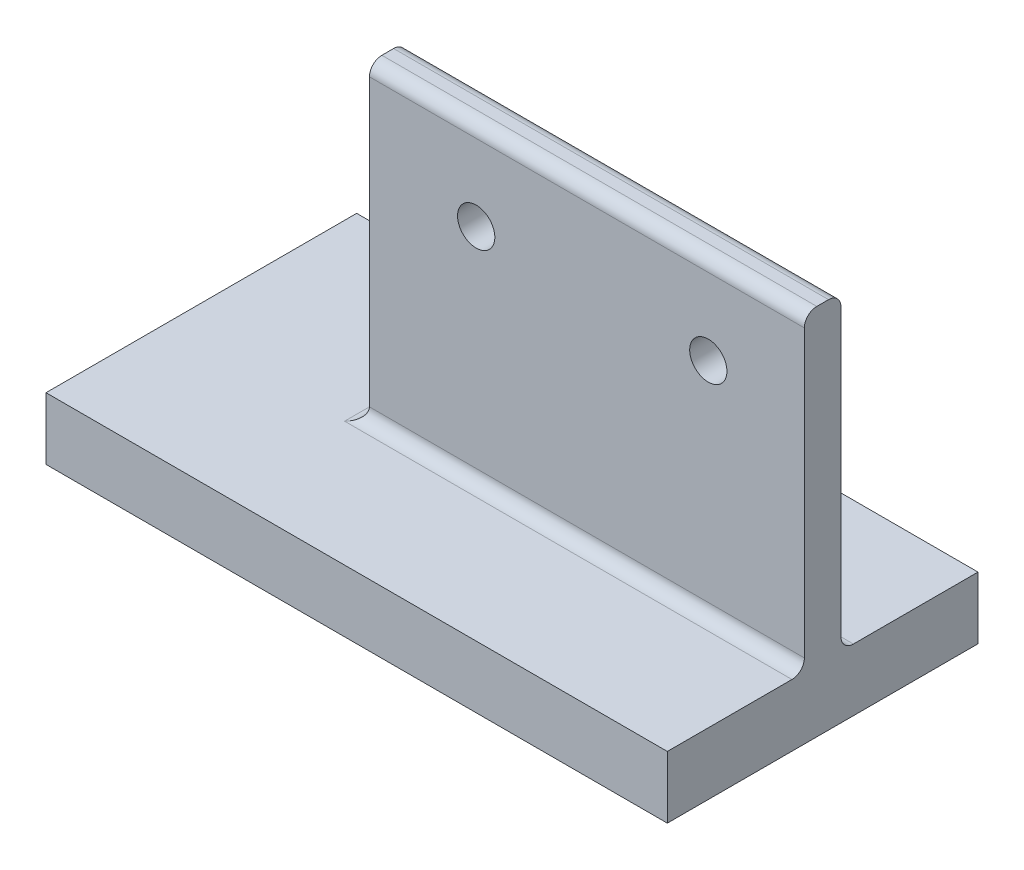
ISO-10303-21;
HEADER;
FILE_DESCRIPTION(('STEP AP214'),'2;1');
FILE_NAME('part.step','',(''),(''),'','','');
FILE_SCHEMA(('AUTOMOTIVE_DESIGN { 1 0 10303 214 1 1 1 1 }'));
ENDSEC;
DATA;
#1=APPLICATION_CONTEXT('core data for automotive mechanical design processes');
#2=APPLICATION_PROTOCOL_DEFINITION('international standard','automotive_design',2000,#1);
#3=PRODUCT_CONTEXT('',#1,'mechanical');
#4=PRODUCT('Part','Part','',(#3));
#5=PRODUCT_RELATED_PRODUCT_CATEGORY('part','',(#4));
#6=PRODUCT_DEFINITION_FORMATION('','',#4);
#7=PRODUCT_DEFINITION_CONTEXT('part definition',#1,'design');
#8=PRODUCT_DEFINITION('design','',#6,#7);
#9=PRODUCT_DEFINITION_SHAPE('','',#8);
#10=(LENGTH_UNIT() NAMED_UNIT(*) SI_UNIT(.MILLI.,.METRE.));
#11=(NAMED_UNIT(*) PLANE_ANGLE_UNIT() SI_UNIT($,.RADIAN.));
#12=(NAMED_UNIT(*) SI_UNIT($,.STERADIAN.) SOLID_ANGLE_UNIT());
#13=UNCERTAINTY_MEASURE_WITH_UNIT(LENGTH_MEASURE(1.E-05),#10,'distance_accuracy_value','');
#14=(GEOMETRIC_REPRESENTATION_CONTEXT(3) GLOBAL_UNCERTAINTY_ASSIGNED_CONTEXT((#13)) GLOBAL_UNIT_ASSIGNED_CONTEXT((#10,
#11,#12)) REPRESENTATION_CONTEXT('',''));
#15=CARTESIAN_POINT('',(0.,0.,0.));
#16=DIRECTION('',(0.,0.,1.));
#17=DIRECTION('',(1.,0.,0.));
#18=AXIS2_PLACEMENT_3D('',#15,#16,#17);
#19=CARTESIAN_POINT('',(0.,58.,0.805009899484307));
#20=DIRECTION('',(1.,0.,0.));
#21=DIRECTION('',(0.,0.,-1.));
#22=AXIS2_PLACEMENT_3D('',#19,#20,#21);
#23=CYLINDRICAL_SURFACE('',#22,2.);
#24=DIRECTION('',(1.,0.,0.));
#25=VECTOR('',#24,1.);
#26=CARTESIAN_POINT('',(0.,58.,-1.19499010051569));
#27=LINE('',#26,#25);
#28=CARTESIAN_POINT('',(-13.1001890359168,58.,-1.19499010051569));
#29=VERTEX_POINT('',#28);
#30=CARTESIAN_POINT('',(56.8998109640832,58.,-1.19499010051569));
#31=VERTEX_POINT('',#30);
#32=EDGE_CURVE('E173',#29,#31,#27,.T.);
#33=ORIENTED_EDGE('',*,*,#32,.F.);
#34=CARTESIAN_POINT('',(-13.1001890359168,58.,0.805009899484307));
#35=DIRECTION('',(1.,0.,0.));
#36=DIRECTION('',(0.,0.,-1.));
#37=AXIS2_PLACEMENT_3D('',#34,#35,#36);
#38=CIRCLE('',#37,2.);
#39=CARTESIAN_POINT('',(-13.1001890359168,60.,0.805009899484307));
#40=VERTEX_POINT('',#39);
#41=EDGE_CURVE('E179',#40,#29,#38,.F.);
#42=ORIENTED_EDGE('',*,*,#41,.F.);
#43=DIRECTION('',(1.,0.,0.));
#44=VECTOR('',#43,1.);
#45=CARTESIAN_POINT('',(0.,60.,0.805009899484307));
#46=LINE('',#45,#44);
#47=CARTESIAN_POINT('',(56.8998109640832,60.,0.805009899484307));
#48=VERTEX_POINT('',#47);
#49=EDGE_CURVE('E176',#48,#40,#46,.F.);
#50=ORIENTED_EDGE('',*,*,#49,.F.);
#51=CARTESIAN_POINT('',(56.8998109640832,58.,0.805009899484307));
#52=DIRECTION('',(-1.,0.,0.));
#53=DIRECTION('',(0.,0.,1.));
#54=AXIS2_PLACEMENT_3D('',#51,#52,#53);
#55=CIRCLE('',#54,2.);
#56=EDGE_CURVE('E181',#31,#48,#55,.F.);
#57=ORIENTED_EDGE('',*,*,#56,.F.);
#58=EDGE_LOOP('',(#33,#42,#50,#57));
#59=FACE_BOUND('',#58,.T.);
#60=ADVANCED_FACE('F35',(#59),#23,.T.);
#61=CARTESIAN_POINT('',(0.,58.,2.69215456176333));
#62=DIRECTION('',(1.,0.,0.));
#63=DIRECTION('',(0.,0.,-1.));
#64=AXIS2_PLACEMENT_3D('',#61,#62,#63);
#65=CYLINDRICAL_SURFACE('',#64,2.);
#66=DIRECTION('',(-1.,0.,0.));
#67=VECTOR('',#66,1.);
#68=CARTESIAN_POINT('',(0.,58.,4.69215456176333));
#69=LINE('',#68,#67);
#70=CARTESIAN_POINT('',(56.8998109640832,58.,4.69215456176333));
#71=VERTEX_POINT('',#70);
#72=CARTESIAN_POINT('',(-13.1001890359168,58.,4.69215456176333));
#73=VERTEX_POINT('',#72);
#74=EDGE_CURVE('E149',#71,#73,#69,.T.);
#75=ORIENTED_EDGE('',*,*,#74,.F.);
#76=CARTESIAN_POINT('',(56.8998109640832,58.,2.69215456176333));
#77=DIRECTION('',(-1.,0.,0.));
#78=DIRECTION('',(0.,0.,1.));
#79=AXIS2_PLACEMENT_3D('',#76,#77,#78);
#80=CIRCLE('',#79,2.);
#81=CARTESIAN_POINT('',(56.8998109640832,60.,2.69215456176333));
#82=VERTEX_POINT('',#81);
#83=EDGE_CURVE('E168',#82,#71,#80,.F.);
#84=ORIENTED_EDGE('',*,*,#83,.F.);
#85=DIRECTION('',(-1.,0.,0.));
#86=VECTOR('',#85,1.);
#87=CARTESIAN_POINT('',(0.,60.,2.69215456176333));
#88=LINE('',#87,#86);
#89=CARTESIAN_POINT('',(-13.1001890359168,60.,2.69215456176333));
#90=VERTEX_POINT('',#89);
#91=EDGE_CURVE('E152',#90,#82,#88,.F.);
#92=ORIENTED_EDGE('',*,*,#91,.F.);
#93=CARTESIAN_POINT('',(-13.1001890359168,58.,2.69215456176333));
#94=DIRECTION('',(1.,0.,0.));
#95=DIRECTION('',(0.,0.,-1.));
#96=AXIS2_PLACEMENT_3D('',#93,#94,#95);
#97=CIRCLE('',#96,2.);
#98=EDGE_CURVE('E170',#73,#90,#97,.F.);
#99=ORIENTED_EDGE('',*,*,#98,.F.);
#100=EDGE_LOOP('',(#75,#84,#92,#99));
#101=FACE_BOUND('',#100,.T.);
#102=ADVANCED_FACE('F272',(#101),#65,.T.);
#103=CARTESIAN_POINT('',(-43.1001890359168,10.,-23.2514177693762));
#104=DIRECTION('',(1.,0.,0.));
#105=DIRECTION('',(0.,0.,-1.));
#106=AXIS2_PLACEMENT_3D('',#103,#104,#105);
#107=PLANE('',#106);
#108=DIRECTION('',(0.,0.,1.));
#109=VECTOR('',#108,1.);
#110=CARTESIAN_POINT('',(-43.1001890359168,0.,-23.2514177693762));
#111=LINE('',#110,#109);
#112=CARTESIAN_POINT('',(-43.1001890359168,0.,-23.2514177693762));
#113=VERTEX_POINT('',#112);
#114=CARTESIAN_POINT('',(-43.1001890359168,0.,26.7485822306238));
#115=VERTEX_POINT('',#114);
#116=EDGE_CURVE('E148',#113,#115,#111,.T.);
#117=ORIENTED_EDGE('',*,*,#116,.T.);
#118=DIRECTION('',(0.,-1.,0.));
#119=VECTOR('',#118,1.);
#120=CARTESIAN_POINT('',(-43.1001890359168,10.,26.7485822306238));
#121=LINE('',#120,#119);
#122=CARTESIAN_POINT('',(-43.1001890359168,10.,26.7485822306238));
#123=VERTEX_POINT('',#122);
#124=EDGE_CURVE('E129',#123,#115,#121,.T.);
#125=ORIENTED_EDGE('',*,*,#124,.F.);
#126=DIRECTION('',(0.,0.,1.));
#127=VECTOR('',#126,1.);
#128=CARTESIAN_POINT('',(-43.1001890359168,10.,-23.2514177693762));
#129=LINE('',#128,#127);
#130=CARTESIAN_POINT('',(-43.1001890359168,10.,-23.2514177693762));
#131=VERTEX_POINT('',#130);
#132=EDGE_CURVE('E135',#131,#123,#129,.T.);
#133=ORIENTED_EDGE('',*,*,#132,.F.);
#134=DIRECTION('',(0.,-1.,0.));
#135=VECTOR('',#134,1.);
#136=CARTESIAN_POINT('',(-43.1001890359168,10.,-23.2514177693762));
#137=LINE('',#136,#135);
#138=EDGE_CURVE('E243',#131,#113,#137,.T.);
#139=ORIENTED_EDGE('',*,*,#138,.T.);
#140=EDGE_LOOP('',(#117,#125,#133,#139));
#141=FACE_BOUND('',#140,.T.);
#142=ADVANCED_FACE('F146',(#141),#107,.F.);
#143=CARTESIAN_POINT('',(-43.1001890359168,10.,26.7485822306238));
#144=DIRECTION('',(0.,0.,-1.));
#145=DIRECTION('',(-1.,0.,0.));
#146=AXIS2_PLACEMENT_3D('',#143,#144,#145);
#147=PLANE('',#146);
#148=DIRECTION('',(1.,0.,0.));
#149=VECTOR('',#148,1.);
#150=CARTESIAN_POINT('',(-43.1001890359168,0.,26.7485822306238));
#151=LINE('',#150,#149);
#152=CARTESIAN_POINT('',(56.8998109640832,0.,26.7485822306238));
#153=VERTEX_POINT('',#152);
#154=EDGE_CURVE('E245',#115,#153,#151,.T.);
#155=ORIENTED_EDGE('',*,*,#154,.T.);
#156=DIRECTION('',(0.,-1.,0.));
#157=VECTOR('',#156,1.);
#158=CARTESIAN_POINT('',(56.8998109640832,10.,26.7485822306238));
#159=LINE('',#158,#157);
#160=CARTESIAN_POINT('',(56.8998109640832,10.,26.7485822306238));
#161=VERTEX_POINT('',#160);
#162=EDGE_CURVE('E132',#161,#153,#159,.T.);
#163=ORIENTED_EDGE('',*,*,#162,.F.);
#164=DIRECTION('',(1.,0.,0.));
#165=VECTOR('',#164,1.);
#166=CARTESIAN_POINT('',(-43.1001890359168,10.,26.7485822306238));
#167=LINE('',#166,#165);
#168=EDGE_CURVE('E125',#123,#161,#167,.T.);
#169=ORIENTED_EDGE('',*,*,#168,.F.);
#170=ORIENTED_EDGE('',*,*,#124,.T.);
#171=EDGE_LOOP('',(#155,#163,#169,#170));
#172=FACE_BOUND('',#171,.T.);
#173=ADVANCED_FACE('F127',(#172),#147,.F.);
#174=CARTESIAN_POINT('',(56.8998109640832,10.,-23.2514177693762));
#175=DIRECTION('',(-1.,0.,0.));
#176=DIRECTION('',(0.,0.,1.));
#177=AXIS2_PLACEMENT_3D('',#174,#175,#176);
#178=PLANE('',#177);
#179=DIRECTION('',(0.,-1.,0.));
#180=VECTOR('',#179,1.);
#181=CARTESIAN_POINT('',(56.8998109640832,60.,-1.19499010051569));
#182=LINE('',#181,#180);
#183=CARTESIAN_POINT('',(56.8998109640832,12.,-1.19499010051569));
#184=VERTEX_POINT('',#183);
#185=EDGE_CURVE('E209',#31,#184,#182,.T.);
#186=ORIENTED_EDGE('',*,*,#185,.F.);
#187=ORIENTED_EDGE('',*,*,#56,.T.);
#188=DIRECTION('',(0.,0.,1.));
#189=VECTOR('',#188,1.);
#190=CARTESIAN_POINT('',(56.8998109640832,60.,0.));
#191=LINE('',#190,#189);
#192=EDGE_CURVE('E235',#48,#82,#191,.T.);
#193=ORIENTED_EDGE('',*,*,#192,.T.);
#194=ORIENTED_EDGE('',*,*,#83,.T.);
#195=DIRECTION('',(0.,-1.,0.));
#196=VECTOR('',#195,1.);
#197=CARTESIAN_POINT('',(56.8998109640832,60.,4.69215456176333));
#198=LINE('',#197,#196);
#199=CARTESIAN_POINT('',(56.8998109640832,12.,4.69215456176333));
#200=VERTEX_POINT('',#199);
#201=EDGE_CURVE('E227',#71,#200,#198,.T.);
#202=ORIENTED_EDGE('',*,*,#201,.T.);
#203=CARTESIAN_POINT('',(56.8998109640832,12.,6.69215456176333));
#204=DIRECTION('',(-1.,0.,0.));
#205=DIRECTION('',(0.,0.,1.));
#206=AXIS2_PLACEMENT_3D('',#203,#204,#205);
#207=CIRCLE('',#206,2.);
#208=CARTESIAN_POINT('',(56.8998109640832,10.,6.69215456176334));
#209=VERTEX_POINT('',#208);
#210=EDGE_CURVE('E192',#200,#209,#207,.T.);
#211=ORIENTED_EDGE('',*,*,#210,.T.);
#212=DIRECTION('',(0.,0.,-1.));
#213=VECTOR('',#212,1.);
#214=CARTESIAN_POINT('',(56.8998109640832,10.,-23.2514177693762));
#215=LINE('',#214,#213);
#216=EDGE_CURVE('E240',#161,#209,#215,.T.);
#217=ORIENTED_EDGE('',*,*,#216,.F.);
#218=ORIENTED_EDGE('',*,*,#162,.T.);
#219=DIRECTION('',(0.,0.,-1.));
#220=VECTOR('',#219,1.);
#221=CARTESIAN_POINT('',(56.8998109640832,0.,-23.2514177693762));
#222=LINE('',#221,#220);
#223=CARTESIAN_POINT('',(56.8998109640832,0.,-23.2514177693762));
#224=VERTEX_POINT('',#223);
#225=EDGE_CURVE('E247',#153,#224,#222,.T.);
#226=ORIENTED_EDGE('',*,*,#225,.T.);
#227=DIRECTION('',(0.,-1.,0.));
#228=VECTOR('',#227,1.);
#229=CARTESIAN_POINT('',(56.8998109640832,10.,-23.2514177693762));
#230=LINE('',#229,#228);
#231=CARTESIAN_POINT('',(56.8998109640832,10.,-23.2514177693762));
#232=VERTEX_POINT('',#231);
#233=EDGE_CURVE('E154',#232,#224,#230,.T.);
#234=ORIENTED_EDGE('',*,*,#233,.F.);
#235=CARTESIAN_POINT('',(56.8998109640832,10.,-3.19499010051569));
#236=VERTEX_POINT('',#235);
#237=EDGE_CURVE('E134',#236,#232,#215,.T.);
#238=ORIENTED_EDGE('',*,*,#237,.F.);
#239=CARTESIAN_POINT('',(56.8998109640832,12.,-3.19499010051569));
#240=DIRECTION('',(-1.,0.,0.));
#241=DIRECTION('',(0.,0.,1.));
#242=AXIS2_PLACEMENT_3D('',#239,#240,#241);
#243=CIRCLE('',#242,2.);
#244=EDGE_CURVE('E187',#236,#184,#243,.T.);
#245=ORIENTED_EDGE('',*,*,#244,.T.);
#246=EDGE_LOOP('',(#186,#187,#193,#194,#202,#211,#217,#218,#226,#234,#238,#245));
#247=FACE_BOUND('',#246,.T.);
#248=ADVANCED_FACE('F229',(#247),#178,.F.);
#249=CARTESIAN_POINT('',(-43.1001890359168,10.,-23.2514177693762));
#250=DIRECTION('',(0.,0.,1.));
#251=DIRECTION('',(1.,0.,0.));
#252=AXIS2_PLACEMENT_3D('',#249,#250,#251);
#253=PLANE('',#252);
#254=DIRECTION('',(-1.,0.,0.));
#255=VECTOR('',#254,1.);
#256=CARTESIAN_POINT('',(-43.1001890359168,0.,-23.2514177693762));
#257=LINE('',#256,#255);
#258=EDGE_CURVE('E144',#224,#113,#257,.T.);
#259=ORIENTED_EDGE('',*,*,#258,.T.);
#260=ORIENTED_EDGE('',*,*,#138,.F.);
#261=DIRECTION('',(-1.,0.,0.));
#262=VECTOR('',#261,1.);
#263=CARTESIAN_POINT('',(-43.1001890359168,10.,-23.2514177693762));
#264=LINE('',#263,#262);
#265=EDGE_CURVE('E140',#232,#131,#264,.T.);
#266=ORIENTED_EDGE('',*,*,#265,.F.);
#267=ORIENTED_EDGE('',*,*,#233,.T.);
#268=EDGE_LOOP('',(#259,#260,#266,#267));
#269=FACE_BOUND('',#268,.T.);
#270=ADVANCED_FACE('F254',(#269),#253,.F.);
#271=CARTESIAN_POINT('',(0.,10.,0.));
#272=DIRECTION('',(0.,1.,0.));
#273=DIRECTION('',(0.,0.,1.));
#274=AXIS2_PLACEMENT_3D('',#271,#272,#273);
#275=PLANE('',#274);
#276=DIRECTION('',(0.,0.,-1.));
#277=VECTOR('',#276,1.);
#278=CARTESIAN_POINT('',(-15.1001890359168,10.,0.));
#279=LINE('',#278,#277);
#280=CARTESIAN_POINT('',(-15.1001890359168,10.,6.69215456176333));
#281=VERTEX_POINT('',#280);
#282=CARTESIAN_POINT('',(-15.1001890359168,10.,-3.19499010051569));
#283=VERTEX_POINT('',#282);
#284=EDGE_CURVE('E194',#281,#283,#279,.T.);
#285=ORIENTED_EDGE('',*,*,#284,.T.);
#286=DIRECTION('',(-1.,0.,0.));
#287=VECTOR('',#286,1.);
#288=CARTESIAN_POINT('',(56.8998109640832,10.,-3.19499010051569));
#289=LINE('',#288,#287);
#290=EDGE_CURVE('E50',#283,#236,#289,.F.);
#291=ORIENTED_EDGE('',*,*,#290,.T.);
#292=ORIENTED_EDGE('',*,*,#237,.T.);
#293=ORIENTED_EDGE('',*,*,#265,.T.);
#294=ORIENTED_EDGE('',*,*,#132,.T.);
#295=ORIENTED_EDGE('',*,*,#168,.T.);
#296=ORIENTED_EDGE('',*,*,#216,.T.);
#297=DIRECTION('',(-1.,0.,0.));
#298=VECTOR('',#297,1.);
#299=CARTESIAN_POINT('',(0.,10.,6.69215456176333));
#300=LINE('',#299,#298);
#301=EDGE_CURVE('E58',#209,#281,#300,.T.);
#302=ORIENTED_EDGE('',*,*,#301,.T.);
#303=EDGE_LOOP('',(#285,#291,#292,#293,#294,#295,#296,#302));
#304=FACE_BOUND('',#303,.T.);
#305=ADVANCED_FACE('F138',(#304),#275,.T.);
#306=CARTESIAN_POINT('',(0.,0.,0.));
#307=DIRECTION('',(0.,1.,0.));
#308=DIRECTION('',(0.,0.,1.));
#309=AXIS2_PLACEMENT_3D('',#306,#307,#308);
#310=PLANE('',#309);
#311=ORIENTED_EDGE('',*,*,#258,.F.);
#312=ORIENTED_EDGE('',*,*,#225,.F.);
#313=ORIENTED_EDGE('',*,*,#154,.F.);
#314=ORIENTED_EDGE('',*,*,#116,.F.);
#315=EDGE_LOOP('',(#311,#312,#313,#314));
#316=FACE_BOUND('',#315,.T.);
#317=ADVANCED_FACE('F258',(#316),#310,.F.);
#318=CARTESIAN_POINT('',(0.,60.,-1.19499010051569));
#319=DIRECTION('',(0.,0.,-1.));
#320=DIRECTION('',(-1.,0.,0.));
#321=AXIS2_PLACEMENT_3D('',#318,#319,#320);
#322=PLANE('',#321);
#323=CARTESIAN_POINT('',(41.4377263161198,45.7139933486825,-1.19499010051569));
#324=DIRECTION('',(0.,0.,-1.));
#325=DIRECTION('',(-1.,0.,0.));
#326=AXIS2_PLACEMENT_3D('',#323,#324,#325);
#327=CIRCLE('',#326,3.);
#328=CARTESIAN_POINT('',(38.4377263161198,45.7139933486825,-1.19499010051569));
#329=VERTEX_POINT('',#328);
#330=EDGE_CURVE('E162',#329,#329,#327,.F.);
#331=ORIENTED_EDGE('',*,*,#330,.T.);
#332=EDGE_LOOP('',(#331));
#333=FACE_BOUND('',#332,.T.);
#334=CARTESIAN_POINT('',(4.07852591292654,45.7139933486825,-1.19499010051569));
#335=DIRECTION('',(0.,0.,-1.));
#336=DIRECTION('',(-1.,0.,0.));
#337=AXIS2_PLACEMENT_3D('',#334,#335,#336);
#338=CIRCLE('',#337,3.);
#339=CARTESIAN_POINT('',(1.07852591292654,45.7139933486825,-1.19499010051569));
#340=VERTEX_POINT('',#339);
#341=EDGE_CURVE('E161',#340,#340,#338,.F.);
#342=ORIENTED_EDGE('',*,*,#341,.T.);
#343=EDGE_LOOP('',(#342));
#344=FACE_BOUND('',#343,.T.);
#345=ORIENTED_EDGE('',*,*,#185,.T.);
#346=DIRECTION('',(-1.,0.,0.));
#347=VECTOR('',#346,1.);
#348=CARTESIAN_POINT('',(-13.1001890359168,12.,-1.19499010051569));
#349=LINE('',#348,#347);
#350=CARTESIAN_POINT('',(-13.1001890359168,12.,-1.19499010051569));
#351=VERTEX_POINT('',#350);
#352=EDGE_CURVE('E183',#184,#351,#349,.T.);
#353=ORIENTED_EDGE('',*,*,#352,.T.);
#354=DIRECTION('',(0.,-1.,0.));
#355=VECTOR('',#354,1.);
#356=CARTESIAN_POINT('',(-13.1001890359168,60.,-1.19499010051569));
#357=LINE('',#356,#355);
#358=EDGE_CURVE('E207',#29,#351,#357,.T.);
#359=ORIENTED_EDGE('',*,*,#358,.F.);
#360=ORIENTED_EDGE('',*,*,#32,.T.);
#361=EDGE_LOOP('',(#345,#353,#359,#360));
#362=FACE_BOUND('',#361,.T.);
#363=ADVANCED_FACE('F206',(#333,#344,#362),#322,.T.);
#364=CARTESIAN_POINT('',(-13.1001890359168,60.,0.));
#365=DIRECTION('',(1.,0.,0.));
#366=DIRECTION('',(0.,0.,-1.));
#367=AXIS2_PLACEMENT_3D('',#364,#365,#366);
#368=PLANE('',#367);
#369=ORIENTED_EDGE('',*,*,#358,.T.);
#370=DIRECTION('',(0.,0.,-1.));
#371=VECTOR('',#370,1.);
#372=CARTESIAN_POINT('',(-13.1001890359168,12.,0.));
#373=LINE('',#372,#371);
#374=CARTESIAN_POINT('',(-13.1001890359168,12.,4.69215456176333));
#375=VERTEX_POINT('',#374);
#376=EDGE_CURVE('E196',#351,#375,#373,.F.);
#377=ORIENTED_EDGE('',*,*,#376,.T.);
#378=DIRECTION('',(0.,-1.,0.));
#379=VECTOR('',#378,1.);
#380=CARTESIAN_POINT('',(-13.1001890359168,60.,4.69215456176333));
#381=LINE('',#380,#379);
#382=EDGE_CURVE('E216',#73,#375,#381,.T.);
#383=ORIENTED_EDGE('',*,*,#382,.F.);
#384=ORIENTED_EDGE('',*,*,#98,.T.);
#385=DIRECTION('',(0.,0.,1.));
#386=VECTOR('',#385,1.);
#387=CARTESIAN_POINT('',(-13.1001890359168,60.,0.));
#388=LINE('',#387,#386);
#389=EDGE_CURVE('E232',#40,#90,#388,.T.);
#390=ORIENTED_EDGE('',*,*,#389,.F.);
#391=ORIENTED_EDGE('',*,*,#41,.T.);
#392=EDGE_LOOP('',(#369,#377,#383,#384,#390,#391));
#393=FACE_BOUND('',#392,.T.);
#394=ADVANCED_FACE('F211',(#393),#368,.F.);
#395=CARTESIAN_POINT('',(0.,60.,4.69215456176333));
#396=DIRECTION('',(0.,0.,-1.));
#397=DIRECTION('',(-1.,0.,0.));
#398=AXIS2_PLACEMENT_3D('',#395,#396,#397);
#399=PLANE('',#398);
#400=CARTESIAN_POINT('',(41.4377263161198,45.7139933486825,4.69215456176333));
#401=DIRECTION('',(0.,0.,-1.));
#402=DIRECTION('',(-1.,0.,0.));
#403=AXIS2_PLACEMENT_3D('',#400,#401,#402);
#404=CIRCLE('',#403,3.);
#405=CARTESIAN_POINT('',(38.4377263161198,45.7139933486825,4.69215456176333));
#406=VERTEX_POINT('',#405);
#407=EDGE_CURVE('E163',#406,#406,#404,.F.);
#408=ORIENTED_EDGE('',*,*,#407,.F.);
#409=EDGE_LOOP('',(#408));
#410=FACE_BOUND('',#409,.T.);
#411=CARTESIAN_POINT('',(4.07852591292654,45.7139933486825,4.69215456176333));
#412=DIRECTION('',(0.,0.,-1.));
#413=DIRECTION('',(-1.,0.,0.));
#414=AXIS2_PLACEMENT_3D('',#411,#412,#413);
#415=CIRCLE('',#414,3.);
#416=CARTESIAN_POINT('',(1.07852591292654,45.7139933486825,4.69215456176333));
#417=VERTEX_POINT('',#416);
#418=EDGE_CURVE('E158',#417,#417,#415,.F.);
#419=ORIENTED_EDGE('',*,*,#418,.F.);
#420=EDGE_LOOP('',(#419));
#421=FACE_BOUND('',#420,.T.);
#422=ORIENTED_EDGE('',*,*,#382,.T.);
#423=DIRECTION('',(-1.,0.,0.));
#424=VECTOR('',#423,1.);
#425=CARTESIAN_POINT('',(0.,12.,4.69215456176333));
#426=LINE('',#425,#424);
#427=EDGE_CURVE('E190',#375,#200,#426,.F.);
#428=ORIENTED_EDGE('',*,*,#427,.T.);
#429=ORIENTED_EDGE('',*,*,#201,.F.);
#430=ORIENTED_EDGE('',*,*,#74,.T.);
#431=EDGE_LOOP('',(#422,#428,#429,#430));
#432=FACE_BOUND('',#431,.T.);
#433=ADVANCED_FACE('F226',(#410,#421,#432),#399,.F.);
#434=CARTESIAN_POINT('',(0.,60.,0.));
#435=DIRECTION('',(0.,1.,0.));
#436=DIRECTION('',(0.,0.,1.));
#437=AXIS2_PLACEMENT_3D('',#434,#435,#436);
#438=PLANE('',#437);
#439=ORIENTED_EDGE('',*,*,#192,.F.);
#440=ORIENTED_EDGE('',*,*,#49,.T.);
#441=ORIENTED_EDGE('',*,*,#389,.T.);
#442=ORIENTED_EDGE('',*,*,#91,.T.);
#443=EDGE_LOOP('',(#439,#440,#441,#442));
#444=FACE_BOUND('',#443,.T.);
#445=ADVANCED_FACE('F310',(#444),#438,.T.);
#446=CARTESIAN_POINT('',(4.07852591292654,45.7139933486825,14.6921545617633));
#447=DIRECTION('',(0.,0.,-1.));
#448=DIRECTION('',(-1.,0.,0.));
#449=AXIS2_PLACEMENT_3D('',#446,#447,#448);
#450=CYLINDRICAL_SURFACE('',#449,3.);
#451=ORIENTED_EDGE('',*,*,#341,.F.);
#452=EDGE_LOOP('',(#451));
#453=FACE_BOUND('',#452,.T.);
#454=ORIENTED_EDGE('',*,*,#418,.T.);
#455=EDGE_LOOP('',(#454));
#456=FACE_BOUND('',#455,.T.);
#457=ADVANCED_FACE('F338',(#453,#456),#450,.F.);
#458=CARTESIAN_POINT('',(41.4377263161198,45.7139933486825,14.6921545617633));
#459=DIRECTION('',(0.,0.,-1.));
#460=DIRECTION('',(-1.,0.,0.));
#461=AXIS2_PLACEMENT_3D('',#458,#459,#460);
#462=CYLINDRICAL_SURFACE('',#461,3.);
#463=ORIENTED_EDGE('',*,*,#330,.F.);
#464=EDGE_LOOP('',(#463));
#465=FACE_BOUND('',#464,.T.);
#466=ORIENTED_EDGE('',*,*,#407,.T.);
#467=EDGE_LOOP('',(#466));
#468=FACE_BOUND('',#467,.T.);
#469=ADVANCED_FACE('F283',(#465,#468),#462,.F.);
#470=CARTESIAN_POINT('',(0.,12.,-3.19499010051569));
#471=DIRECTION('',(1.,0.,0.));
#472=DIRECTION('',(0.,0.,-1.));
#473=AXIS2_PLACEMENT_3D('',#470,#471,#472);
#474=CYLINDRICAL_SURFACE('',#473,2.);
#475=ORIENTED_EDGE('',*,*,#244,.F.);
#476=ORIENTED_EDGE('',*,*,#290,.F.);
#477=CARTESIAN_POINT('',(-15.1001890359168,12.,-3.19499010051569));
#478=DIRECTION('',(0.707106781186547,0.,-0.707106781186547));
#479=DIRECTION('',(0.707106781186547,0.,0.707106781186547));
#480=AXIS2_PLACEMENT_3D('',#477,#478,#479);
#481=ELLIPSE('',#480,2.82842712474619,2.);
#482=EDGE_CURVE('E43',#283,#351,#481,.F.);
#483=ORIENTED_EDGE('',*,*,#482,.T.);
#484=ORIENTED_EDGE('',*,*,#352,.F.);
#485=EDGE_LOOP('',(#475,#476,#483,#484));
#486=FACE_BOUND('',#485,.T.);
#487=ADVANCED_FACE('F198',(#486),#474,.F.);
#488=CARTESIAN_POINT('',(0.,12.,6.69215456176333));
#489=DIRECTION('',(-1.,0.,0.));
#490=DIRECTION('',(0.,0.,1.));
#491=AXIS2_PLACEMENT_3D('',#488,#489,#490);
#492=CYLINDRICAL_SURFACE('',#491,2.);
#493=ORIENTED_EDGE('',*,*,#210,.F.);
#494=ORIENTED_EDGE('',*,*,#427,.F.);
#495=CARTESIAN_POINT('',(-15.1001890359168,12.,6.69215456176333));
#496=DIRECTION('',(-0.707106781186547,0.,-0.707106781186547));
#497=DIRECTION('',(-0.707106781186547,0.,0.707106781186547));
#498=AXIS2_PLACEMENT_3D('',#495,#496,#497);
#499=ELLIPSE('',#498,2.82842712474619,2.);
#500=EDGE_CURVE('E11',#375,#281,#499,.T.);
#501=ORIENTED_EDGE('',*,*,#500,.T.);
#502=ORIENTED_EDGE('',*,*,#301,.F.);
#503=EDGE_LOOP('',(#493,#494,#501,#502));
#504=FACE_BOUND('',#503,.T.);
#505=ADVANCED_FACE('F222',(#504),#492,.F.);
#506=CARTESIAN_POINT('',(-15.1001890359168,12.,0.));
#507=DIRECTION('',(0.,0.,-1.));
#508=DIRECTION('',(-1.,0.,0.));
#509=AXIS2_PLACEMENT_3D('',#506,#507,#508);
#510=CYLINDRICAL_SURFACE('',#509,2.);
#511=ORIENTED_EDGE('',*,*,#500,.F.);
#512=ORIENTED_EDGE('',*,*,#376,.F.);
#513=ORIENTED_EDGE('',*,*,#482,.F.);
#514=ORIENTED_EDGE('',*,*,#284,.F.);
#515=EDGE_LOOP('',(#511,#512,#513,#514));
#516=FACE_BOUND('',#515,.T.);
#517=ADVANCED_FACE('F37',(#516),#510,.F.);
#518=CLOSED_SHELL('',(#60,#102,#142,#173,#248,#270,#305,#317,#363,#394,#433,#445,#457,#469,#487,
#505,#517));
#519=MANIFOLD_SOLID_BREP('B2',#518);
#520=ADVANCED_BREP_SHAPE_REPRESENTATION('',(#18,#519),#14);
#521=SHAPE_DEFINITION_REPRESENTATION(#9,#520);
ENDSEC;
END-ISO-10303-21;
